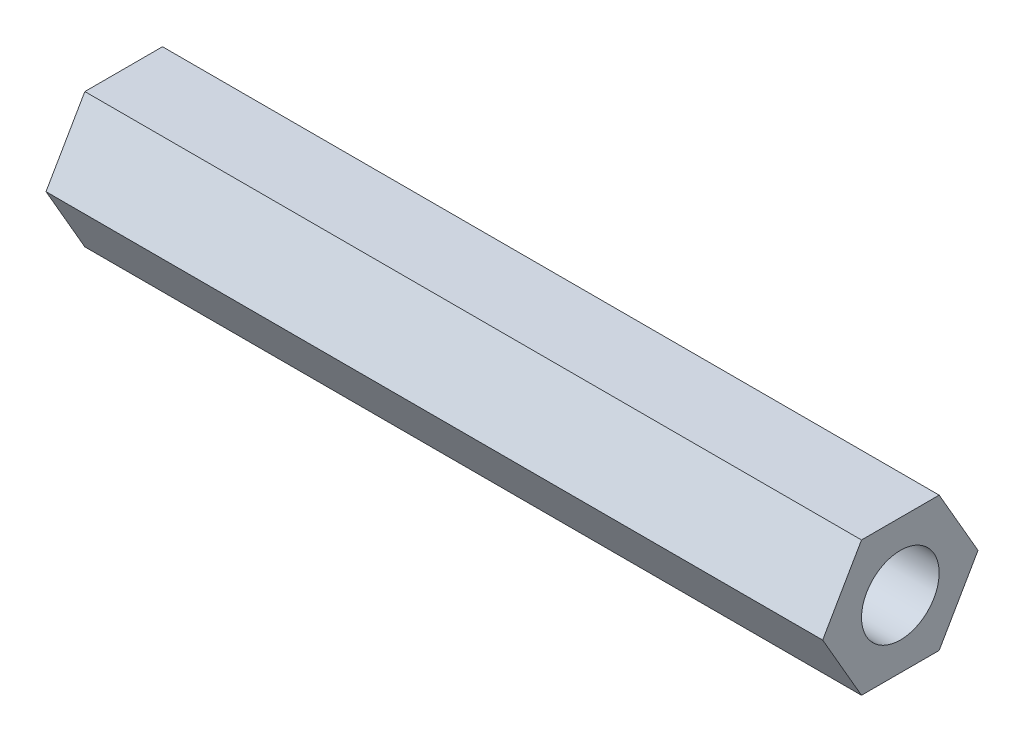
ISO-10303-21;
HEADER;
FILE_DESCRIPTION(('STEP AP214'),'2;1');
FILE_NAME('part.step','',(''),(''),'','','');
FILE_SCHEMA(('AUTOMOTIVE_DESIGN { 1 0 10303 214 1 1 1 1 }'));
ENDSEC;
DATA;
#1=APPLICATION_CONTEXT('core data for automotive mechanical design processes');
#2=APPLICATION_PROTOCOL_DEFINITION('international standard','automotive_design',2000,#1);
#3=PRODUCT_CONTEXT('',#1,'mechanical');
#4=PRODUCT('Part','Part','',(#3));
#5=PRODUCT_RELATED_PRODUCT_CATEGORY('part','',(#4));
#6=PRODUCT_DEFINITION_FORMATION('','',#4);
#7=PRODUCT_DEFINITION_CONTEXT('part definition',#1,'design');
#8=PRODUCT_DEFINITION('design','',#6,#7);
#9=PRODUCT_DEFINITION_SHAPE('','',#8);
#10=(LENGTH_UNIT() NAMED_UNIT(*) SI_UNIT(.MILLI.,.METRE.));
#11=(NAMED_UNIT(*) PLANE_ANGLE_UNIT() SI_UNIT($,.RADIAN.));
#12=(NAMED_UNIT(*) SI_UNIT($,.STERADIAN.) SOLID_ANGLE_UNIT());
#13=UNCERTAINTY_MEASURE_WITH_UNIT(LENGTH_MEASURE(1.E-05),#10,'distance_accuracy_value','');
#14=(GEOMETRIC_REPRESENTATION_CONTEXT(3) GLOBAL_UNCERTAINTY_ASSIGNED_CONTEXT((#13)) GLOBAL_UNIT_ASSIGNED_CONTEXT((#10,
#11,#12)) REPRESENTATION_CONTEXT('',''));
#15=CARTESIAN_POINT('',(0.,0.,0.));
#16=DIRECTION('',(0.,0.,1.));
#17=DIRECTION('',(1.,0.,0.));
#18=AXIS2_PLACEMENT_3D('',#15,#16,#17);
#19=CARTESIAN_POINT('',(63.5,-5.4992682460469,-3.17498799336631));
#20=DIRECTION('',(0.,0.500001890806071,0.866024312124292));
#21=DIRECTION('',(0.,-0.866024312124292,0.500001890806071));
#22=AXIS2_PLACEMENT_3D('',#19,#20,#21);
#23=PLANE('',#22);
#24=DIRECTION('',(0.,0.866024312124292,-0.500001890806071));
#25=VECTOR('',#24,1.);
#26=CARTESIAN_POINT('',(0.,-5.4992682460469,-3.17498799336631));
#27=LINE('',#26,#25);
#28=CARTESIAN_POINT('',(0.,-5.4992682460469,-3.17498799336631));
#29=VERTEX_POINT('',#28);
#30=CARTESIAN_POINT('',(0.,-1.38640576428382E-05,-6.34999999998486));
#31=VERTEX_POINT('',#30);
#32=EDGE_CURVE('E117',#29,#31,#27,.T.);
#33=ORIENTED_EDGE('',*,*,#32,.T.);
#34=DIRECTION('',(-1.,0.,0.));
#35=VECTOR('',#34,1.);
#36=CARTESIAN_POINT('',(63.5,-1.38640576428382E-05,-6.34999999998486));
#37=LINE('',#36,#35);
#38=CARTESIAN_POINT('',(63.5,-1.38640576428382E-05,-6.34999999998486));
#39=VERTEX_POINT('',#38);
#40=EDGE_CURVE('E11',#39,#31,#37,.T.);
#41=ORIENTED_EDGE('',*,*,#40,.F.);
#42=DIRECTION('',(0.,0.866024312124292,-0.500001890806071));
#43=VECTOR('',#42,1.);
#44=CARTESIAN_POINT('',(63.5,-5.4992682460469,-3.17498799336631));
#45=LINE('',#44,#43);
#46=CARTESIAN_POINT('',(63.5,-5.4992682460469,-3.17498799336631));
#47=VERTEX_POINT('',#46);
#48=EDGE_CURVE('E128',#47,#39,#45,.T.);
#49=ORIENTED_EDGE('',*,*,#48,.F.);
#50=DIRECTION('',(-1.,0.,0.));
#51=VECTOR('',#50,1.);
#52=CARTESIAN_POINT('',(63.5,-5.4992682460469,-3.17498799336631));
#53=LINE('',#52,#51);
#54=EDGE_CURVE('E113',#47,#29,#53,.T.);
#55=ORIENTED_EDGE('',*,*,#54,.T.);
#56=EDGE_LOOP('',(#33,#41,#49,#55));
#57=FACE_BOUND('',#56,.T.);
#58=ADVANCED_FACE('F33',(#57),#23,.F.);
#59=CARTESIAN_POINT('',(63.5,-1.38640576428382E-05,-6.34999999998486));
#60=DIRECTION('',(0.,-0.499998109191545,0.866026495440457));
#61=DIRECTION('',(0.,-0.866026495440457,-0.499998109191545));
#62=AXIS2_PLACEMENT_3D('',#59,#60,#61);
#63=PLANE('',#62);
#64=DIRECTION('',(0.,0.866026495440457,0.499998109191545));
#65=VECTOR('',#64,1.);
#66=CARTESIAN_POINT('',(0.,-1.38640576428382E-05,-6.34999999998486));
#67=LINE('',#66,#65);
#68=CARTESIAN_POINT('',(0.,5.49925438198926,-3.17501200661855));
#69=VERTEX_POINT('',#68);
#70=EDGE_CURVE('E120',#31,#69,#67,.T.);
#71=ORIENTED_EDGE('',*,*,#70,.T.);
#72=DIRECTION('',(-1.,0.,0.));
#73=VECTOR('',#72,1.);
#74=CARTESIAN_POINT('',(63.5,5.49925438198926,-3.17501200661855));
#75=LINE('',#74,#73);
#76=CARTESIAN_POINT('',(63.5,5.49925438198926,-3.17501200661855));
#77=VERTEX_POINT('',#76);
#78=EDGE_CURVE('E41',#77,#69,#75,.T.);
#79=ORIENTED_EDGE('',*,*,#78,.F.);
#80=DIRECTION('',(0.,0.866026495440457,0.499998109191545));
#81=VECTOR('',#80,1.);
#82=CARTESIAN_POINT('',(63.5,-1.38640576428382E-05,-6.34999999998486));
#83=LINE('',#82,#81);
#84=EDGE_CURVE('E86',#39,#77,#83,.T.);
#85=ORIENTED_EDGE('',*,*,#84,.F.);
#86=ORIENTED_EDGE('',*,*,#40,.T.);
#87=EDGE_LOOP('',(#71,#79,#85,#86));
#88=FACE_BOUND('',#87,.T.);
#89=ADVANCED_FACE('F153',(#88),#63,.F.);
#90=CARTESIAN_POINT('',(63.5,5.49925438198926,-3.17501200661855));
#91=DIRECTION('',(0.,-0.999999999997617,2.18331616456291E-06));
#92=DIRECTION('',(0.,-2.18331616456291E-06,-0.999999999997617));
#93=AXIS2_PLACEMENT_3D('',#90,#91,#92);
#94=PLANE('',#93);
#95=DIRECTION('',(0.,2.18331616456291E-06,0.999999999997617));
#96=VECTOR('',#95,1.);
#97=CARTESIAN_POINT('',(0.,5.49925438198926,-3.17501200661855));
#98=LINE('',#97,#96);
#99=CARTESIAN_POINT('',(0.,5.4992682460469,3.17498799336631));
#100=VERTEX_POINT('',#99);
#101=EDGE_CURVE('E123',#69,#100,#98,.T.);
#102=ORIENTED_EDGE('',*,*,#101,.T.);
#103=DIRECTION('',(-1.,0.,0.));
#104=VECTOR('',#103,1.);
#105=CARTESIAN_POINT('',(63.5,5.4992682460469,3.17498799336631));
#106=LINE('',#105,#104);
#107=CARTESIAN_POINT('',(63.5,5.4992682460469,3.17498799336631));
#108=VERTEX_POINT('',#107);
#109=EDGE_CURVE('E108',#108,#100,#106,.T.);
#110=ORIENTED_EDGE('',*,*,#109,.F.);
#111=DIRECTION('',(0.,2.18331616456291E-06,0.999999999997617));
#112=VECTOR('',#111,1.);
#113=CARTESIAN_POINT('',(63.5,5.49925438198926,-3.17501200661855));
#114=LINE('',#113,#112);
#115=EDGE_CURVE('E99',#77,#108,#114,.T.);
#116=ORIENTED_EDGE('',*,*,#115,.F.);
#117=ORIENTED_EDGE('',*,*,#78,.T.);
#118=EDGE_LOOP('',(#102,#110,#116,#117));
#119=FACE_BOUND('',#118,.T.);
#120=ADVANCED_FACE('F134',(#119),#94,.F.);
#121=CARTESIAN_POINT('',(63.5,5.4992682460469,3.17498799336631));
#122=DIRECTION('',(0.,-0.500001890806071,-0.866024312124292));
#123=DIRECTION('',(0.,0.866024312124292,-0.500001890806071));
#124=AXIS2_PLACEMENT_3D('',#121,#122,#123);
#125=PLANE('',#124);
#126=DIRECTION('',(0.,-0.866024312124292,0.500001890806071));
#127=VECTOR('',#126,1.);
#128=CARTESIAN_POINT('',(0.,5.4992682460469,3.17498799336631));
#129=LINE('',#128,#127);
#130=CARTESIAN_POINT('',(0.,1.38640576455113E-05,6.34999999998487));
#131=VERTEX_POINT('',#130);
#132=EDGE_CURVE('E107',#100,#131,#129,.T.);
#133=ORIENTED_EDGE('',*,*,#132,.T.);
#134=DIRECTION('',(-1.,0.,0.));
#135=VECTOR('',#134,1.);
#136=CARTESIAN_POINT('',(63.5,1.38640576455113E-05,6.34999999998487));
#137=LINE('',#136,#135);
#138=CARTESIAN_POINT('',(63.5,1.38640576455113E-05,6.34999999998487));
#139=VERTEX_POINT('',#138);
#140=EDGE_CURVE('E104',#139,#131,#137,.T.);
#141=ORIENTED_EDGE('',*,*,#140,.F.);
#142=DIRECTION('',(0.,-0.866024312124292,0.500001890806071));
#143=VECTOR('',#142,1.);
#144=CARTESIAN_POINT('',(63.5,5.4992682460469,3.17498799336631));
#145=LINE('',#144,#143);
#146=EDGE_CURVE('E93',#108,#139,#145,.T.);
#147=ORIENTED_EDGE('',*,*,#146,.F.);
#148=ORIENTED_EDGE('',*,*,#109,.T.);
#149=EDGE_LOOP('',(#133,#141,#147,#148));
#150=FACE_BOUND('',#149,.T.);
#151=ADVANCED_FACE('F105',(#150),#125,.F.);
#152=CARTESIAN_POINT('',(63.5,1.38640576455113E-05,6.34999999998487));
#153=DIRECTION('',(0.,0.499998109191545,-0.866026495440457));
#154=DIRECTION('',(0.,0.866026495440457,0.499998109191545));
#155=AXIS2_PLACEMENT_3D('',#152,#153,#154);
#156=PLANE('',#155);
#157=DIRECTION('',(0.,-0.866026495440457,-0.499998109191545));
#158=VECTOR('',#157,1.);
#159=CARTESIAN_POINT('',(0.,1.38640576455113E-05,6.34999999998487));
#160=LINE('',#159,#158);
#161=CARTESIAN_POINT('',(0.,-5.49925438198926,3.17501200661855));
#162=VERTEX_POINT('',#161);
#163=EDGE_CURVE('E72',#131,#162,#160,.T.);
#164=ORIENTED_EDGE('',*,*,#163,.T.);
#165=DIRECTION('',(-1.,0.,0.));
#166=VECTOR('',#165,1.);
#167=CARTESIAN_POINT('',(63.5,-5.49925438198926,3.17501200661855));
#168=LINE('',#167,#166);
#169=CARTESIAN_POINT('',(63.5,-5.49925438198926,3.17501200661855));
#170=VERTEX_POINT('',#169);
#171=EDGE_CURVE('E109',#170,#162,#168,.T.);
#172=ORIENTED_EDGE('',*,*,#171,.F.);
#173=DIRECTION('',(0.,-0.866026495440457,-0.499998109191545));
#174=VECTOR('',#173,1.);
#175=CARTESIAN_POINT('',(63.5,1.38640576455113E-05,6.34999999998487));
#176=LINE('',#175,#174);
#177=EDGE_CURVE('E97',#139,#170,#176,.T.);
#178=ORIENTED_EDGE('',*,*,#177,.F.);
#179=ORIENTED_EDGE('',*,*,#140,.T.);
#180=EDGE_LOOP('',(#164,#172,#178,#179));
#181=FACE_BOUND('',#180,.T.);
#182=ADVANCED_FACE('F111',(#181),#156,.F.);
#183=CARTESIAN_POINT('',(63.5,-5.49925438198926,3.17501200661855));
#184=DIRECTION('',(0.,0.999999999997617,-2.18331616483609E-06));
#185=DIRECTION('',(0.,2.18331616483609E-06,0.999999999997617));
#186=AXIS2_PLACEMENT_3D('',#183,#184,#185);
#187=PLANE('',#186);
#188=DIRECTION('',(0.,-2.18331616483609E-06,-0.999999999997617));
#189=VECTOR('',#188,1.);
#190=CARTESIAN_POINT('',(0.,-5.49925438198926,3.17501200661855));
#191=LINE('',#190,#189);
#192=EDGE_CURVE('E78',#162,#29,#191,.T.);
#193=ORIENTED_EDGE('',*,*,#192,.T.);
#194=ORIENTED_EDGE('',*,*,#54,.F.);
#195=DIRECTION('',(0.,-2.18331616483609E-06,-0.999999999997617));
#196=VECTOR('',#195,1.);
#197=CARTESIAN_POINT('',(63.5,-5.49925438198926,3.17501200661855));
#198=LINE('',#197,#196);
#199=EDGE_CURVE('E49',#170,#47,#198,.T.);
#200=ORIENTED_EDGE('',*,*,#199,.F.);
#201=ORIENTED_EDGE('',*,*,#171,.T.);
#202=EDGE_LOOP('',(#193,#194,#200,#201));
#203=FACE_BOUND('',#202,.T.);
#204=ADVANCED_FACE('F141',(#203),#187,.F.);
#205=CARTESIAN_POINT('',(63.5,0.,0.));
#206=DIRECTION('',(1.,0.,0.));
#207=DIRECTION('',(0.,0.,-1.));
#208=AXIS2_PLACEMENT_3D('',#205,#206,#207);
#209=PLANE('',#208);
#210=CARTESIAN_POINT('',(63.5,0.,0.));
#211=DIRECTION('',(-1.,0.,0.));
#212=DIRECTION('',(0.,0.,1.));
#213=AXIS2_PLACEMENT_3D('',#210,#211,#212);
#214=CIRCLE('',#213,3.175);
#215=CARTESIAN_POINT('',(63.5,0.,3.175));
#216=VERTEX_POINT('',#215);
#217=EDGE_CURVE('E121',#216,#216,#214,.T.);
#218=ORIENTED_EDGE('',*,*,#217,.T.);
#219=EDGE_LOOP('',(#218));
#220=FACE_BOUND('',#219,.T.);
#221=ORIENTED_EDGE('',*,*,#48,.T.);
#222=ORIENTED_EDGE('',*,*,#84,.T.);
#223=ORIENTED_EDGE('',*,*,#115,.T.);
#224=ORIENTED_EDGE('',*,*,#146,.T.);
#225=ORIENTED_EDGE('',*,*,#177,.T.);
#226=ORIENTED_EDGE('',*,*,#199,.T.);
#227=EDGE_LOOP('',(#221,#222,#223,#224,#225,#226));
#228=FACE_BOUND('',#227,.T.);
#229=ADVANCED_FACE('F95',(#220,#228),#209,.T.);
#230=CARTESIAN_POINT('',(0.,0.,0.));
#231=DIRECTION('',(1.,0.,0.));
#232=DIRECTION('',(0.,0.,-1.));
#233=AXIS2_PLACEMENT_3D('',#230,#231,#232);
#234=PLANE('',#233);
#235=CARTESIAN_POINT('',(0.,0.,0.));
#236=DIRECTION('',(-1.,0.,0.));
#237=DIRECTION('',(0.,0.,1.));
#238=AXIS2_PLACEMENT_3D('',#235,#236,#237);
#239=CIRCLE('',#238,3.175);
#240=CARTESIAN_POINT('',(0.,0.,3.175));
#241=VERTEX_POINT('',#240);
#242=EDGE_CURVE('E208',#241,#241,#239,.T.);
#243=ORIENTED_EDGE('',*,*,#242,.F.);
#244=EDGE_LOOP('',(#243));
#245=FACE_BOUND('',#244,.T.);
#246=ORIENTED_EDGE('',*,*,#32,.F.);
#247=ORIENTED_EDGE('',*,*,#192,.F.);
#248=ORIENTED_EDGE('',*,*,#163,.F.);
#249=ORIENTED_EDGE('',*,*,#132,.F.);
#250=ORIENTED_EDGE('',*,*,#101,.F.);
#251=ORIENTED_EDGE('',*,*,#70,.F.);
#252=EDGE_LOOP('',(#246,#247,#248,#249,#250,#251));
#253=FACE_BOUND('',#252,.T.);
#254=ADVANCED_FACE('F137',(#245,#253),#234,.F.);
#255=CARTESIAN_POINT('',(63.5,0.,0.));
#256=DIRECTION('',(-1.,0.,0.));
#257=DIRECTION('',(0.,0.,1.));
#258=AXIS2_PLACEMENT_3D('',#255,#256,#257);
#259=CYLINDRICAL_SURFACE('',#258,3.175);
#260=ORIENTED_EDGE('',*,*,#217,.F.);
#261=EDGE_LOOP('',(#260));
#262=FACE_BOUND('',#261,.T.);
#263=ORIENTED_EDGE('',*,*,#242,.T.);
#264=EDGE_LOOP('',(#263));
#265=FACE_BOUND('',#264,.T.);
#266=ADVANCED_FACE('F190',(#262,#265),#259,.F.);
#267=CLOSED_SHELL('',(#58,#89,#120,#151,#182,#204,#229,#254,#266));
#268=MANIFOLD_SOLID_BREP('B2',#267);
#269=ADVANCED_BREP_SHAPE_REPRESENTATION('',(#18,#268),#14);
#270=SHAPE_DEFINITION_REPRESENTATION(#9,#269);
ENDSEC;
END-ISO-10303-21;
